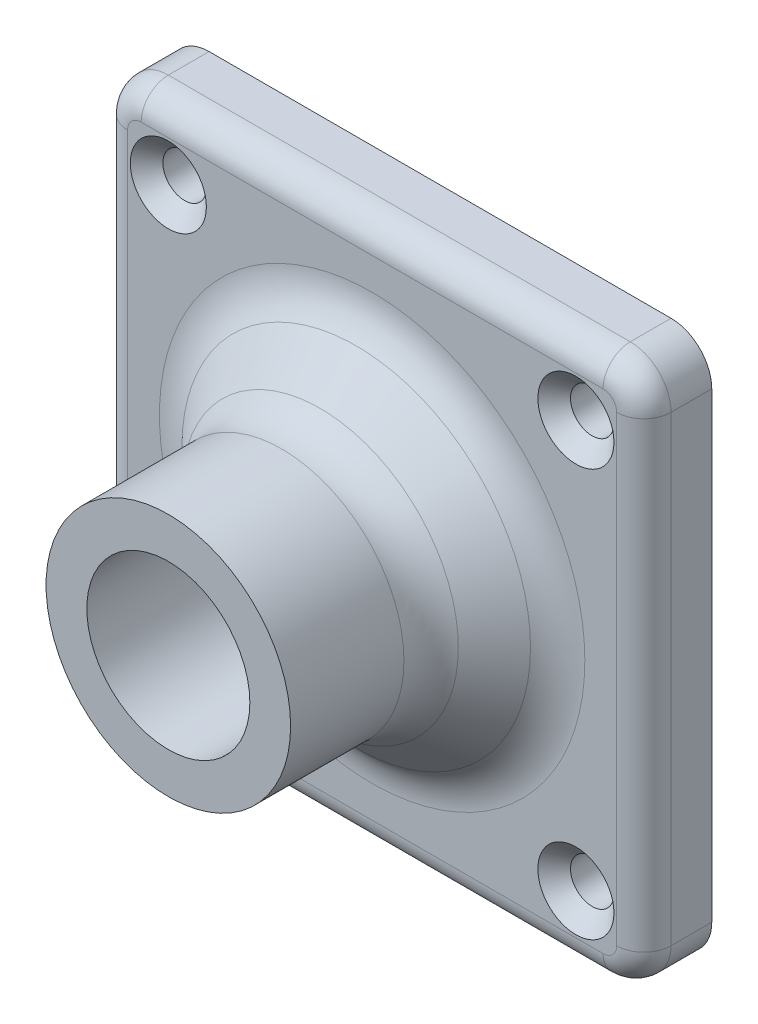
ISO-10303-21;
HEADER;
FILE_DESCRIPTION(('STEP AP214'),'2;1');
FILE_NAME('part.step','',(''),(''),'','','');
FILE_SCHEMA(('AUTOMOTIVE_DESIGN { 1 0 10303 214 1 1 1 1 }'));
ENDSEC;
DATA;
#1=APPLICATION_CONTEXT('core data for automotive mechanical design processes');
#2=APPLICATION_PROTOCOL_DEFINITION('international standard','automotive_design',2000,#1);
#3=PRODUCT_CONTEXT('',#1,'mechanical');
#4=PRODUCT('Part','Part','',(#3));
#5=PRODUCT_RELATED_PRODUCT_CATEGORY('part','',(#4));
#6=PRODUCT_DEFINITION_FORMATION('','',#4);
#7=PRODUCT_DEFINITION_CONTEXT('part definition',#1,'design');
#8=PRODUCT_DEFINITION('design','',#6,#7);
#9=PRODUCT_DEFINITION_SHAPE('','',#8);
#10=(LENGTH_UNIT() NAMED_UNIT(*) SI_UNIT(.MILLI.,.METRE.));
#11=(NAMED_UNIT(*) PLANE_ANGLE_UNIT() SI_UNIT($,.RADIAN.));
#12=(NAMED_UNIT(*) SI_UNIT($,.STERADIAN.) SOLID_ANGLE_UNIT());
#13=UNCERTAINTY_MEASURE_WITH_UNIT(LENGTH_MEASURE(1.E-05),#10,'distance_accuracy_value','');
#14=(GEOMETRIC_REPRESENTATION_CONTEXT(3) GLOBAL_UNCERTAINTY_ASSIGNED_CONTEXT((#13)) GLOBAL_UNIT_ASSIGNED_CONTEXT((#10,
#11,#12)) REPRESENTATION_CONTEXT('',''));
#15=CARTESIAN_POINT('',(0.,0.,0.));
#16=DIRECTION('',(0.,0.,1.));
#17=DIRECTION('',(1.,0.,0.));
#18=AXIS2_PLACEMENT_3D('',#15,#16,#17);
#19=CARTESIAN_POINT('',(-135.000000000005,-82.312657818665,20.));
#20=DIRECTION('',(0.,0.,1.));
#21=DIRECTION('',(1.,0.,0.));
#22=AXIS2_PLACEMENT_3D('',#19,#20,#21);
#23=PLANE('',#22);
#24=CARTESIAN_POINT('',(-135.000000000005,-82.312657818665,20.));
#25=DIRECTION('',(0.,0.,1.));
#26=DIRECTION('',(1.,0.,0.));
#27=AXIS2_PLACEMENT_3D('',#24,#25,#26);
#28=CIRCLE('',#27,9.00000000000001);
#29=CARTESIAN_POINT('',(-126.000000000005,-82.312657818665,20.));
#30=VERTEX_POINT('',#29);
#31=EDGE_CURVE('E191',#30,#30,#28,.T.);
#32=ORIENTED_EDGE('',*,*,#31,.T.);
#33=EDGE_LOOP('',(#32));
#34=FACE_BOUND('',#33,.T.);
#35=CARTESIAN_POINT('',(-135.000000000005,-82.312657818665,20.));
#36=DIRECTION('',(0.,0.,1.));
#37=DIRECTION('',(1.,0.,0.));
#38=AXIS2_PLACEMENT_3D('',#35,#36,#37);
#39=CIRCLE('',#38,5.99999999999999);
#40=CARTESIAN_POINT('',(-129.000000000005,-82.312657818665,20.));
#41=VERTEX_POINT('',#40);
#42=EDGE_CURVE('E188',#41,#41,#39,.T.);
#43=ORIENTED_EDGE('',*,*,#42,.F.);
#44=EDGE_LOOP('',(#43));
#45=FACE_BOUND('',#44,.T.);
#46=ADVANCED_FACE('F35',(#34,#45),#23,.T.);
#47=CARTESIAN_POINT('',(-135.000000000005,-82.312657818665,0.));
#48=DIRECTION('',(0.,0.,1.));
#49=DIRECTION('',(1.,0.,0.));
#50=AXIS2_PLACEMENT_3D('',#47,#48,#49);
#51=PLANE('',#50);
#52=CARTESIAN_POINT('',(-150.000000000005,-97.312657818665,0.));
#53=DIRECTION('',(0.,0.,1.));
#54=DIRECTION('',(1.,0.,0.));
#55=AXIS2_PLACEMENT_3D('',#52,#53,#54);
#56=CIRCLE('',#55,1.59999999999999);
#57=CARTESIAN_POINT('',(-148.400000000005,-97.312657818665,0.));
#58=VERTEX_POINT('',#57);
#59=EDGE_CURVE('E158',#58,#58,#56,.T.);
#60=ORIENTED_EDGE('',*,*,#59,.T.);
#61=EDGE_LOOP('',(#60));
#62=FACE_BOUND('',#61,.T.);
#63=CARTESIAN_POINT('',(-120.000000000005,-97.312657818665,0.));
#64=DIRECTION('',(0.,0.,1.));
#65=DIRECTION('',(1.,0.,0.));
#66=AXIS2_PLACEMENT_3D('',#63,#64,#65);
#67=CIRCLE('',#66,1.59999999999999);
#68=CARTESIAN_POINT('',(-118.400000000005,-97.312657818665,0.));
#69=VERTEX_POINT('',#68);
#70=EDGE_CURVE('E389',#69,#69,#67,.T.);
#71=ORIENTED_EDGE('',*,*,#70,.T.);
#72=EDGE_LOOP('',(#71));
#73=FACE_BOUND('',#72,.T.);
#74=CARTESIAN_POINT('',(-120.000000000005,-67.312657818665,0.));
#75=DIRECTION('',(0.,0.,1.));
#76=DIRECTION('',(1.,0.,0.));
#77=AXIS2_PLACEMENT_3D('',#74,#75,#76);
#78=CIRCLE('',#77,1.59999999999999);
#79=CARTESIAN_POINT('',(-118.400000000005,-67.312657818665,0.));
#80=VERTEX_POINT('',#79);
#81=EDGE_CURVE('E386',#80,#80,#78,.T.);
#82=ORIENTED_EDGE('',*,*,#81,.T.);
#83=EDGE_LOOP('',(#82));
#84=FACE_BOUND('',#83,.T.);
#85=CARTESIAN_POINT('',(-150.000000000005,-67.312657818665,0.));
#86=DIRECTION('',(0.,0.,1.));
#87=DIRECTION('',(1.,0.,0.));
#88=AXIS2_PLACEMENT_3D('',#85,#86,#87);
#89=CIRCLE('',#88,1.59999999999999);
#90=CARTESIAN_POINT('',(-148.400000000005,-67.312657818665,0.));
#91=VERTEX_POINT('',#90);
#92=EDGE_CURVE('E384',#91,#91,#89,.T.);
#93=ORIENTED_EDGE('',*,*,#92,.T.);
#94=EDGE_LOOP('',(#93));
#95=FACE_BOUND('',#94,.T.);
#96=CARTESIAN_POINT('',(-135.000000000005,-82.312657818665,0.));
#97=DIRECTION('',(0.,0.,1.));
#98=DIRECTION('',(1.,0.,0.));
#99=AXIS2_PLACEMENT_3D('',#96,#97,#98);
#100=CIRCLE('',#99,5.99999999999999);
#101=CARTESIAN_POINT('',(-129.000000000005,-82.312657818665,0.));
#102=VERTEX_POINT('',#101);
#103=EDGE_CURVE('E176',#102,#102,#100,.T.);
#104=ORIENTED_EDGE('',*,*,#103,.T.);
#105=EDGE_LOOP('',(#104));
#106=FACE_BOUND('',#105,.T.);
#107=CARTESIAN_POINT('',(-118.000000000005,-99.312657818665,0.));
#108=DIRECTION('',(0.,0.,-1.));
#109=DIRECTION('',(1.,0.,0.));
#110=AXIS2_PLACEMENT_3D('',#107,#108,#109);
#111=CIRCLE('',#110,3.);
#112=CARTESIAN_POINT('',(-115.000000000005,-99.312657818665,0.));
#113=VERTEX_POINT('',#112);
#114=CARTESIAN_POINT('',(-118.000000000005,-102.312657818665,0.));
#115=VERTEX_POINT('',#114);
#116=EDGE_CURVE('E131',#113,#115,#111,.T.);
#117=ORIENTED_EDGE('',*,*,#116,.T.);
#118=DIRECTION('',(-1.,0.,0.));
#119=VECTOR('',#118,1.);
#120=CARTESIAN_POINT('',(-152.000000000005,-102.312657818665,0.));
#121=LINE('',#120,#119);
#122=CARTESIAN_POINT('',(-152.000000000005,-102.312657818665,0.));
#123=VERTEX_POINT('',#122);
#124=EDGE_CURVE('E141',#115,#123,#121,.T.);
#125=ORIENTED_EDGE('',*,*,#124,.T.);
#126=CARTESIAN_POINT('',(-152.000000000005,-99.312657818665,0.));
#127=DIRECTION('',(0.,0.,-1.));
#128=DIRECTION('',(-1.,0.,0.));
#129=AXIS2_PLACEMENT_3D('',#126,#127,#128);
#130=CIRCLE('',#129,3.00000000000002);
#131=CARTESIAN_POINT('',(-155.000000000005,-99.312657818665,0.));
#132=VERTEX_POINT('',#131);
#133=EDGE_CURVE('E147',#123,#132,#130,.T.);
#134=ORIENTED_EDGE('',*,*,#133,.T.);
#135=DIRECTION('',(0.,1.,0.));
#136=VECTOR('',#135,1.);
#137=CARTESIAN_POINT('',(-155.000000000005,-99.312657818665,0.));
#138=LINE('',#137,#136);
#139=CARTESIAN_POINT('',(-155.000000000005,-65.312657818665,0.));
#140=VERTEX_POINT('',#139);
#141=EDGE_CURVE('E162',#132,#140,#138,.T.);
#142=ORIENTED_EDGE('',*,*,#141,.T.);
#143=CARTESIAN_POINT('',(-152.000000000005,-65.312657818665,0.));
#144=DIRECTION('',(0.,0.,-1.));
#145=DIRECTION('',(-1.,0.,0.));
#146=AXIS2_PLACEMENT_3D('',#143,#144,#145);
#147=CIRCLE('',#146,3.);
#148=CARTESIAN_POINT('',(-152.000000000005,-62.312657818665,0.));
#149=VERTEX_POINT('',#148);
#150=EDGE_CURVE('E165',#140,#149,#147,.T.);
#151=ORIENTED_EDGE('',*,*,#150,.T.);
#152=DIRECTION('',(1.,0.,0.));
#153=VECTOR('',#152,1.);
#154=CARTESIAN_POINT('',(-152.000000000005,-62.312657818665,0.));
#155=LINE('',#154,#153);
#156=CARTESIAN_POINT('',(-118.000000000005,-62.312657818665,0.));
#157=VERTEX_POINT('',#156);
#158=EDGE_CURVE('E168',#149,#157,#155,.T.);
#159=ORIENTED_EDGE('',*,*,#158,.T.);
#160=CARTESIAN_POINT('',(-118.000000000005,-65.312657818665,0.));
#161=DIRECTION('',(0.,0.,-1.));
#162=DIRECTION('',(-1.,0.,0.));
#163=AXIS2_PLACEMENT_3D('',#160,#161,#162);
#164=CIRCLE('',#163,2.99999999999999);
#165=CARTESIAN_POINT('',(-115.000000000005,-65.312657818665,0.));
#166=VERTEX_POINT('',#165);
#167=EDGE_CURVE('E171',#157,#166,#164,.T.);
#168=ORIENTED_EDGE('',*,*,#167,.T.);
#169=DIRECTION('',(0.,-1.,0.));
#170=VECTOR('',#169,1.);
#171=CARTESIAN_POINT('',(-115.000000000005,-99.312657818665,0.));
#172=LINE('',#171,#170);
#173=EDGE_CURVE('E138',#166,#113,#172,.T.);
#174=ORIENTED_EDGE('',*,*,#173,.T.);
#175=EDGE_LOOP('',(#117,#125,#134,#142,#151,#159,#168,#174));
#176=FACE_BOUND('',#175,.T.);
#177=ADVANCED_FACE('F149',(#62,#73,#84,#95,#106,#176),#51,.F.);
#178=CARTESIAN_POINT('',(-135.000000000005,-82.312657818665,20.));
#179=DIRECTION('',(0.,0.,-1.));
#180=DIRECTION('',(-1.,0.,0.));
#181=AXIS2_PLACEMENT_3D('',#178,#179,#180);
#182=CYLINDRICAL_SURFACE('',#181,9.00000000000001);
#183=CARTESIAN_POINT('',(-135.000000000005,-82.312657818665,11.6568542494924));
#184=DIRECTION('',(0.,0.,1.));
#185=DIRECTION('',(1.,0.,0.));
#186=AXIS2_PLACEMENT_3D('',#183,#184,#185);
#187=CIRCLE('',#186,9.00000000000001);
#188=CARTESIAN_POINT('',(-126.000000000005,-82.312657818665,11.6568542494924));
#189=VERTEX_POINT('',#188);
#190=EDGE_CURVE('E227',#189,#189,#187,.T.);
#191=ORIENTED_EDGE('',*,*,#190,.T.);
#192=EDGE_LOOP('',(#191));
#193=FACE_BOUND('',#192,.T.);
#194=ORIENTED_EDGE('',*,*,#31,.F.);
#195=EDGE_LOOP('',(#194));
#196=FACE_BOUND('',#195,.T.);
#197=ADVANCED_FACE('F300',(#193,#196),#182,.T.);
#198=CARTESIAN_POINT('',(-135.000000000005,-82.312657818665,20.));
#199=DIRECTION('',(0.,0.,-1.));
#200=DIRECTION('',(-1.,0.,0.));
#201=AXIS2_PLACEMENT_3D('',#198,#199,#200);
#202=CYLINDRICAL_SURFACE('',#201,5.99999999999999);
#203=ORIENTED_EDGE('',*,*,#42,.T.);
#204=EDGE_LOOP('',(#203));
#205=FACE_BOUND('',#204,.T.);
#206=ORIENTED_EDGE('',*,*,#103,.F.);
#207=EDGE_LOOP('',(#206));
#208=FACE_BOUND('',#207,.T.);
#209=ADVANCED_FACE('F305',(#205,#208),#202,.F.);
#210=CARTESIAN_POINT('',(-118.000000000005,-99.312657818665,5.));
#211=DIRECTION('',(0.,0.,1.));
#212=DIRECTION('',(1.,0.,0.));
#213=AXIS2_PLACEMENT_3D('',#210,#211,#212);
#214=PLANE('',#213);
#215=CARTESIAN_POINT('',(-150.000000000005,-67.312657818665,5.));
#216=DIRECTION('',(0.,0.,1.));
#217=DIRECTION('',(1.,0.,0.));
#218=AXIS2_PLACEMENT_3D('',#215,#216,#217);
#219=CIRCLE('',#218,2.8);
#220=CARTESIAN_POINT('',(-147.200000000005,-67.312657818665,5.));
#221=VERTEX_POINT('',#220);
#222=EDGE_CURVE('E269',#221,#221,#219,.F.);
#223=ORIENTED_EDGE('',*,*,#222,.T.);
#224=EDGE_LOOP('',(#223));
#225=FACE_BOUND('',#224,.T.);
#226=CARTESIAN_POINT('',(-120.000000000005,-67.312657818665,5.));
#227=DIRECTION('',(0.,0.,1.));
#228=DIRECTION('',(1.,0.,0.));
#229=AXIS2_PLACEMENT_3D('',#226,#227,#228);
#230=CIRCLE('',#229,2.8);
#231=CARTESIAN_POINT('',(-117.200000000005,-67.312657818665,5.));
#232=VERTEX_POINT('',#231);
#233=EDGE_CURVE('E266',#232,#232,#230,.F.);
#234=ORIENTED_EDGE('',*,*,#233,.T.);
#235=EDGE_LOOP('',(#234));
#236=FACE_BOUND('',#235,.T.);
#237=CARTESIAN_POINT('',(-120.000000000005,-97.312657818665,5.));
#238=DIRECTION('',(0.,0.,1.));
#239=DIRECTION('',(1.,0.,0.));
#240=AXIS2_PLACEMENT_3D('',#237,#238,#239);
#241=CIRCLE('',#240,2.8);
#242=CARTESIAN_POINT('',(-117.200000000005,-97.312657818665,5.));
#243=VERTEX_POINT('',#242);
#244=EDGE_CURVE('E263',#243,#243,#241,.F.);
#245=ORIENTED_EDGE('',*,*,#244,.T.);
#246=EDGE_LOOP('',(#245));
#247=FACE_BOUND('',#246,.T.);
#248=CARTESIAN_POINT('',(-150.000000000005,-97.312657818665,5.));
#249=DIRECTION('',(0.,0.,1.));
#250=DIRECTION('',(1.,0.,0.));
#251=AXIS2_PLACEMENT_3D('',#248,#249,#250);
#252=CIRCLE('',#251,2.8);
#253=CARTESIAN_POINT('',(-147.200000000005,-97.312657818665,5.));
#254=VERTEX_POINT('',#253);
#255=EDGE_CURVE('E260',#254,#254,#252,.F.);
#256=ORIENTED_EDGE('',*,*,#255,.T.);
#257=EDGE_LOOP('',(#256));
#258=FACE_BOUND('',#257,.T.);
#259=CARTESIAN_POINT('',(-135.000000000005,-82.312657818665,5.));
#260=DIRECTION('',(0.,0.,1.));
#261=DIRECTION('',(1.,0.,0.));
#262=AXIS2_PLACEMENT_3D('',#259,#260,#261);
#263=CIRCLE('',#262,15.6568542494924);
#264=CARTESIAN_POINT('',(-119.343145750513,-82.312657818665,5.));
#265=VERTEX_POINT('',#264);
#266=EDGE_CURVE('E254',#265,#265,#263,.F.);
#267=ORIENTED_EDGE('',*,*,#266,.T.);
#268=EDGE_LOOP('',(#267));
#269=FACE_BOUND('',#268,.T.);
#270=DIRECTION('',(0.,1.,0.));
#271=VECTOR('',#270,1.);
#272=CARTESIAN_POINT('',(-153.000000000005,-99.312657818665,5.));
#273=LINE('',#272,#271);
#274=CARTESIAN_POINT('',(-153.000000000005,-65.312657818665,5.));
#275=VERTEX_POINT('',#274);
#276=CARTESIAN_POINT('',(-153.000000000005,-99.312657818665,5.));
#277=VERTEX_POINT('',#276);
#278=EDGE_CURVE('E199',#275,#277,#273,.F.);
#279=ORIENTED_EDGE('',*,*,#278,.T.);
#280=CARTESIAN_POINT('',(-152.000000000005,-99.312657818665,5.));
#281=DIRECTION('',(0.,0.,1.));
#282=DIRECTION('',(1.,0.,0.));
#283=AXIS2_PLACEMENT_3D('',#280,#281,#282);
#284=CIRCLE('',#283,1.00000000000002);
#285=CARTESIAN_POINT('',(-152.000000000005,-100.312657818665,5.));
#286=VERTEX_POINT('',#285);
#287=EDGE_CURVE('E213',#277,#286,#284,.T.);
#288=ORIENTED_EDGE('',*,*,#287,.T.);
#289=DIRECTION('',(-1.,0.,0.));
#290=VECTOR('',#289,1.);
#291=CARTESIAN_POINT('',(-118.000000000005,-100.312657818665,5.));
#292=LINE('',#291,#290);
#293=CARTESIAN_POINT('',(-118.000000000005,-100.312657818665,5.));
#294=VERTEX_POINT('',#293);
#295=EDGE_CURVE('E211',#286,#294,#292,.F.);
#296=ORIENTED_EDGE('',*,*,#295,.T.);
#297=CARTESIAN_POINT('',(-118.000000000005,-99.312657818665,5.));
#298=DIRECTION('',(0.,0.,1.));
#299=DIRECTION('',(1.,0.,0.));
#300=AXIS2_PLACEMENT_3D('',#297,#298,#299);
#301=CIRCLE('',#300,1.);
#302=CARTESIAN_POINT('',(-117.000000000005,-99.312657818665,5.));
#303=VERTEX_POINT('',#302);
#304=EDGE_CURVE('E209',#294,#303,#301,.T.);
#305=ORIENTED_EDGE('',*,*,#304,.T.);
#306=DIRECTION('',(0.,-1.,0.));
#307=VECTOR('',#306,1.);
#308=CARTESIAN_POINT('',(-117.000000000005,-99.312657818665,5.));
#309=LINE('',#308,#307);
#310=CARTESIAN_POINT('',(-117.000000000005,-65.312657818665,5.));
#311=VERTEX_POINT('',#310);
#312=EDGE_CURVE('E207',#303,#311,#309,.F.);
#313=ORIENTED_EDGE('',*,*,#312,.T.);
#314=CARTESIAN_POINT('',(-118.000000000005,-65.312657818665,5.));
#315=DIRECTION('',(0.,0.,1.));
#316=DIRECTION('',(1.,0.,0.));
#317=AXIS2_PLACEMENT_3D('',#314,#315,#316);
#318=CIRCLE('',#317,0.999999999999992);
#319=CARTESIAN_POINT('',(-118.000000000005,-64.312657818665,5.));
#320=VERTEX_POINT('',#319);
#321=EDGE_CURVE('E205',#311,#320,#318,.T.);
#322=ORIENTED_EDGE('',*,*,#321,.T.);
#323=DIRECTION('',(1.,0.,0.));
#324=VECTOR('',#323,1.);
#325=CARTESIAN_POINT('',(-118.000000000005,-64.312657818665,5.));
#326=LINE('',#325,#324);
#327=CARTESIAN_POINT('',(-152.000000000005,-64.312657818665,5.));
#328=VERTEX_POINT('',#327);
#329=EDGE_CURVE('E203',#320,#328,#326,.F.);
#330=ORIENTED_EDGE('',*,*,#329,.T.);
#331=CARTESIAN_POINT('',(-152.000000000005,-65.312657818665,5.));
#332=DIRECTION('',(0.,0.,1.));
#333=DIRECTION('',(1.,0.,0.));
#334=AXIS2_PLACEMENT_3D('',#331,#332,#333);
#335=CIRCLE('',#334,0.999999999999999);
#336=EDGE_CURVE('E201',#328,#275,#335,.T.);
#337=ORIENTED_EDGE('',*,*,#336,.T.);
#338=EDGE_LOOP('',(#279,#288,#296,#305,#313,#322,#330,#337));
#339=FACE_BOUND('',#338,.T.);
#340=ADVANCED_FACE('F406',(#225,#236,#247,#258,#269,#339),#214,.T.);
#341=CARTESIAN_POINT('',(-118.000000000005,-99.312657818665,5.));
#342=DIRECTION('',(0.,0.,-1.));
#343=DIRECTION('',(-1.,0.,0.));
#344=AXIS2_PLACEMENT_3D('',#341,#342,#343);
#345=CYLINDRICAL_SURFACE('',#344,3.);
#346=DIRECTION('',(0.,0.,-1.));
#347=VECTOR('',#346,1.);
#348=CARTESIAN_POINT('',(-115.000000000005,-99.312657818665,5.));
#349=LINE('',#348,#347);
#350=CARTESIAN_POINT('',(-115.000000000005,-99.312657818665,3.));
#351=VERTEX_POINT('',#350);
#352=EDGE_CURVE('E174',#351,#113,#349,.T.);
#353=ORIENTED_EDGE('',*,*,#352,.F.);
#354=CARTESIAN_POINT('',(-118.000000000005,-99.312657818665,3.));
#355=DIRECTION('',(0.,0.,1.));
#356=DIRECTION('',(1.,0.,0.));
#357=AXIS2_PLACEMENT_3D('',#354,#355,#356);
#358=CIRCLE('',#357,3.);
#359=CARTESIAN_POINT('',(-118.000000000005,-102.312657818665,3.));
#360=VERTEX_POINT('',#359);
#361=EDGE_CURVE('E134',#351,#360,#358,.F.);
#362=ORIENTED_EDGE('',*,*,#361,.T.);
#363=DIRECTION('',(0.,0.,-1.));
#364=VECTOR('',#363,1.);
#365=CARTESIAN_POINT('',(-118.000000000005,-102.312657818665,5.));
#366=LINE('',#365,#364);
#367=EDGE_CURVE('E126',#360,#115,#366,.T.);
#368=ORIENTED_EDGE('',*,*,#367,.T.);
#369=ORIENTED_EDGE('',*,*,#116,.F.);
#370=EDGE_LOOP('',(#353,#362,#368,#369));
#371=FACE_BOUND('',#370,.T.);
#372=ADVANCED_FACE('F129',(#371),#345,.T.);
#373=CARTESIAN_POINT('',(-115.000000000005,-99.312657818665,5.));
#374=DIRECTION('',(1.,0.,0.));
#375=DIRECTION('',(0.,0.,-1.));
#376=AXIS2_PLACEMENT_3D('',#373,#374,#375);
#377=PLANE('',#376);
#378=DIRECTION('',(0.,0.,-1.));
#379=VECTOR('',#378,1.);
#380=CARTESIAN_POINT('',(-115.000000000005,-65.312657818665,5.));
#381=LINE('',#380,#379);
#382=CARTESIAN_POINT('',(-115.000000000005,-65.312657818665,3.));
#383=VERTEX_POINT('',#382);
#384=EDGE_CURVE('E177',#383,#166,#381,.T.);
#385=ORIENTED_EDGE('',*,*,#384,.F.);
#386=DIRECTION('',(0.,-1.,0.));
#387=VECTOR('',#386,1.);
#388=CARTESIAN_POINT('',(-115.000000000005,-99.312657818665,3.));
#389=LINE('',#388,#387);
#390=EDGE_CURVE('E219',#383,#351,#389,.T.);
#391=ORIENTED_EDGE('',*,*,#390,.T.);
#392=ORIENTED_EDGE('',*,*,#352,.T.);
#393=ORIENTED_EDGE('',*,*,#173,.F.);
#394=EDGE_LOOP('',(#385,#391,#392,#393));
#395=FACE_BOUND('',#394,.T.);
#396=ADVANCED_FACE('F410',(#395),#377,.T.);
#397=CARTESIAN_POINT('',(-118.000000000005,-65.312657818665,5.));
#398=DIRECTION('',(0.,0.,-1.));
#399=DIRECTION('',(-1.,0.,0.));
#400=AXIS2_PLACEMENT_3D('',#397,#398,#399);
#401=CYLINDRICAL_SURFACE('',#400,2.99999999999999);
#402=DIRECTION('',(0.,0.,-1.));
#403=VECTOR('',#402,1.);
#404=CARTESIAN_POINT('',(-118.000000000005,-62.312657818665,5.));
#405=LINE('',#404,#403);
#406=CARTESIAN_POINT('',(-118.000000000005,-62.312657818665,3.));
#407=VERTEX_POINT('',#406);
#408=EDGE_CURVE('E179',#407,#157,#405,.T.);
#409=ORIENTED_EDGE('',*,*,#408,.F.);
#410=CARTESIAN_POINT('',(-118.000000000005,-65.312657818665,3.));
#411=DIRECTION('',(0.,0.,1.));
#412=DIRECTION('',(1.,0.,0.));
#413=AXIS2_PLACEMENT_3D('',#410,#411,#412);
#414=CIRCLE('',#413,2.99999999999999);
#415=EDGE_CURVE('E221',#407,#383,#414,.F.);
#416=ORIENTED_EDGE('',*,*,#415,.T.);
#417=ORIENTED_EDGE('',*,*,#384,.T.);
#418=ORIENTED_EDGE('',*,*,#167,.F.);
#419=EDGE_LOOP('',(#409,#416,#417,#418));
#420=FACE_BOUND('',#419,.T.);
#421=ADVANCED_FACE('F413',(#420),#401,.T.);
#422=CARTESIAN_POINT('',(-152.000000000005,-62.312657818665,5.));
#423=DIRECTION('',(0.,1.,0.));
#424=DIRECTION('',(-1.,0.,0.));
#425=AXIS2_PLACEMENT_3D('',#422,#423,#424);
#426=PLANE('',#425);
#427=DIRECTION('',(0.,0.,-1.));
#428=VECTOR('',#427,1.);
#429=CARTESIAN_POINT('',(-152.000000000005,-62.312657818665,5.));
#430=LINE('',#429,#428);
#431=CARTESIAN_POINT('',(-152.000000000005,-62.312657818665,3.));
#432=VERTEX_POINT('',#431);
#433=EDGE_CURVE('E181',#432,#149,#430,.T.);
#434=ORIENTED_EDGE('',*,*,#433,.F.);
#435=DIRECTION('',(1.,0.,0.));
#436=VECTOR('',#435,1.);
#437=CARTESIAN_POINT('',(-152.000000000005,-62.312657818665,3.));
#438=LINE('',#437,#436);
#439=EDGE_CURVE('E223',#432,#407,#438,.T.);
#440=ORIENTED_EDGE('',*,*,#439,.T.);
#441=ORIENTED_EDGE('',*,*,#408,.T.);
#442=ORIENTED_EDGE('',*,*,#158,.F.);
#443=EDGE_LOOP('',(#434,#440,#441,#442));
#444=FACE_BOUND('',#443,.T.);
#445=ADVANCED_FACE('F417',(#444),#426,.T.);
#446=CARTESIAN_POINT('',(-152.000000000005,-65.312657818665,5.));
#447=DIRECTION('',(0.,0.,-1.));
#448=DIRECTION('',(-1.,0.,0.));
#449=AXIS2_PLACEMENT_3D('',#446,#447,#448);
#450=CYLINDRICAL_SURFACE('',#449,3.);
#451=DIRECTION('',(0.,0.,-1.));
#452=VECTOR('',#451,1.);
#453=CARTESIAN_POINT('',(-155.000000000005,-65.312657818665,5.));
#454=LINE('',#453,#452);
#455=CARTESIAN_POINT('',(-155.000000000005,-65.312657818665,3.));
#456=VERTEX_POINT('',#455);
#457=EDGE_CURVE('E183',#456,#140,#454,.T.);
#458=ORIENTED_EDGE('',*,*,#457,.F.);
#459=CARTESIAN_POINT('',(-152.000000000005,-65.312657818665,3.));
#460=DIRECTION('',(0.,0.,1.));
#461=DIRECTION('',(1.,0.,0.));
#462=AXIS2_PLACEMENT_3D('',#459,#460,#461);
#463=CIRCLE('',#462,3.);
#464=EDGE_CURVE('E58',#456,#432,#463,.F.);
#465=ORIENTED_EDGE('',*,*,#464,.T.);
#466=ORIENTED_EDGE('',*,*,#433,.T.);
#467=ORIENTED_EDGE('',*,*,#150,.F.);
#468=EDGE_LOOP('',(#458,#465,#466,#467));
#469=FACE_BOUND('',#468,.T.);
#470=ADVANCED_FACE('F421',(#469),#450,.T.);
#471=CARTESIAN_POINT('',(-155.000000000005,-99.312657818665,5.));
#472=DIRECTION('',(-1.,0.,0.));
#473=DIRECTION('',(0.,-1.,0.));
#474=AXIS2_PLACEMENT_3D('',#471,#472,#473);
#475=PLANE('',#474);
#476=DIRECTION('',(0.,0.,-1.));
#477=VECTOR('',#476,1.);
#478=CARTESIAN_POINT('',(-155.000000000005,-99.312657818665,5.));
#479=LINE('',#478,#477);
#480=CARTESIAN_POINT('',(-155.000000000005,-99.312657818665,3.));
#481=VERTEX_POINT('',#480);
#482=EDGE_CURVE('E185',#481,#132,#479,.T.);
#483=ORIENTED_EDGE('',*,*,#482,.F.);
#484=DIRECTION('',(0.,1.,0.));
#485=VECTOR('',#484,1.);
#486=CARTESIAN_POINT('',(-155.000000000005,-99.312657818665,3.));
#487=LINE('',#486,#485);
#488=EDGE_CURVE('E51',#481,#456,#487,.T.);
#489=ORIENTED_EDGE('',*,*,#488,.T.);
#490=ORIENTED_EDGE('',*,*,#457,.T.);
#491=ORIENTED_EDGE('',*,*,#141,.F.);
#492=EDGE_LOOP('',(#483,#489,#490,#491));
#493=FACE_BOUND('',#492,.T.);
#494=ADVANCED_FACE('F425',(#493),#475,.T.);
#495=CARTESIAN_POINT('',(-152.000000000005,-99.312657818665,5.));
#496=DIRECTION('',(0.,0.,-1.));
#497=DIRECTION('',(-1.,0.,0.));
#498=AXIS2_PLACEMENT_3D('',#495,#496,#497);
#499=CYLINDRICAL_SURFACE('',#498,3.00000000000002);
#500=DIRECTION('',(0.,0.,-1.));
#501=VECTOR('',#500,1.);
#502=CARTESIAN_POINT('',(-152.000000000005,-102.312657818665,5.));
#503=LINE('',#502,#501);
#504=CARTESIAN_POINT('',(-152.000000000005,-102.312657818665,3.));
#505=VERTEX_POINT('',#504);
#506=EDGE_CURVE('E137',#505,#123,#503,.T.);
#507=ORIENTED_EDGE('',*,*,#506,.F.);
#508=CARTESIAN_POINT('',(-152.000000000005,-99.312657818665,3.));
#509=DIRECTION('',(0.,0.,1.));
#510=DIRECTION('',(1.,0.,0.));
#511=AXIS2_PLACEMENT_3D('',#508,#509,#510);
#512=CIRCLE('',#511,3.00000000000002);
#513=EDGE_CURVE('E196',#505,#481,#512,.F.);
#514=ORIENTED_EDGE('',*,*,#513,.T.);
#515=ORIENTED_EDGE('',*,*,#482,.T.);
#516=ORIENTED_EDGE('',*,*,#133,.F.);
#517=EDGE_LOOP('',(#507,#514,#515,#516));
#518=FACE_BOUND('',#517,.T.);
#519=ADVANCED_FACE('F428',(#518),#499,.T.);
#520=CARTESIAN_POINT('',(-152.000000000005,-102.312657818665,5.));
#521=DIRECTION('',(0.,-1.,0.));
#522=DIRECTION('',(1.,0.,0.));
#523=AXIS2_PLACEMENT_3D('',#520,#521,#522);
#524=PLANE('',#523);
#525=ORIENTED_EDGE('',*,*,#367,.F.);
#526=DIRECTION('',(-1.,0.,0.));
#527=VECTOR('',#526,1.);
#528=CARTESIAN_POINT('',(-152.000000000005,-102.312657818665,3.));
#529=LINE('',#528,#527);
#530=EDGE_CURVE('E216',#360,#505,#529,.T.);
#531=ORIENTED_EDGE('',*,*,#530,.T.);
#532=ORIENTED_EDGE('',*,*,#506,.T.);
#533=ORIENTED_EDGE('',*,*,#124,.F.);
#534=EDGE_LOOP('',(#525,#531,#532,#533));
#535=FACE_BOUND('',#534,.T.);
#536=ADVANCED_FACE('F142',(#535),#524,.T.);
#537=CARTESIAN_POINT('',(-118.000000000005,-65.312657818665,3.));
#538=DIRECTION('',(0.,0.,1.));
#539=DIRECTION('',(1.,0.,0.));
#540=AXIS2_PLACEMENT_3D('',#537,#538,#539);
#541=DEGENERATE_TOROIDAL_SURFACE('',#540,0.999999999999992,2.,.T.);
#542=CARTESIAN_POINT('',(-118.000000000005,-64.312657818665,3.));
#543=DIRECTION('',(-1.,0.,0.));
#544=DIRECTION('',(0.,0.,1.));
#545=AXIS2_PLACEMENT_3D('',#542,#543,#544);
#546=CIRCLE('',#545,2.);
#547=EDGE_CURVE('E155',#320,#407,#546,.T.);
#548=ORIENTED_EDGE('',*,*,#547,.F.);
#549=ORIENTED_EDGE('',*,*,#321,.F.);
#550=CARTESIAN_POINT('',(-117.000000000005,-65.312657818665,3.));
#551=DIRECTION('',(0.,-1.,0.));
#552=DIRECTION('',(0.,0.,-1.));
#553=AXIS2_PLACEMENT_3D('',#550,#551,#552);
#554=CIRCLE('',#553,2.);
#555=EDGE_CURVE('E152',#383,#311,#554,.T.);
#556=ORIENTED_EDGE('',*,*,#555,.F.);
#557=ORIENTED_EDGE('',*,*,#415,.F.);
#558=EDGE_LOOP('',(#548,#549,#556,#557));
#559=FACE_BOUND('',#558,.T.);
#560=ADVANCED_FACE('F339',(#559),#541,.T.);
#561=CARTESIAN_POINT('',(-117.000000000005,-99.312657818665,3.));
#562=DIRECTION('',(0.,-1.,0.));
#563=DIRECTION('',(0.,0.,-1.));
#564=AXIS2_PLACEMENT_3D('',#561,#562,#563);
#565=CYLINDRICAL_SURFACE('',#564,2.);
#566=ORIENTED_EDGE('',*,*,#555,.T.);
#567=ORIENTED_EDGE('',*,*,#312,.F.);
#568=CARTESIAN_POINT('',(-117.000000000005,-99.312657818665,3.));
#569=DIRECTION('',(0.,-1.,0.));
#570=DIRECTION('',(0.,0.,-1.));
#571=AXIS2_PLACEMENT_3D('',#568,#569,#570);
#572=CIRCLE('',#571,2.);
#573=EDGE_CURVE('E241',#351,#303,#572,.T.);
#574=ORIENTED_EDGE('',*,*,#573,.F.);
#575=ORIENTED_EDGE('',*,*,#390,.F.);
#576=EDGE_LOOP('',(#566,#567,#574,#575));
#577=FACE_BOUND('',#576,.T.);
#578=ADVANCED_FACE('F335',(#577),#565,.T.);
#579=CARTESIAN_POINT('',(-152.000000000005,-64.312657818665,3.));
#580=DIRECTION('',(1.,0.,0.));
#581=DIRECTION('',(0.,1.,0.));
#582=AXIS2_PLACEMENT_3D('',#579,#580,#581);
#583=CYLINDRICAL_SURFACE('',#582,2.);
#584=ORIENTED_EDGE('',*,*,#547,.T.);
#585=ORIENTED_EDGE('',*,*,#439,.F.);
#586=CARTESIAN_POINT('',(-152.000000000005,-64.312657818665,3.));
#587=DIRECTION('',(-1.,0.,0.));
#588=DIRECTION('',(0.,0.,1.));
#589=AXIS2_PLACEMENT_3D('',#586,#587,#588);
#590=CIRCLE('',#589,2.);
#591=EDGE_CURVE('E238',#328,#432,#590,.T.);
#592=ORIENTED_EDGE('',*,*,#591,.F.);
#593=ORIENTED_EDGE('',*,*,#329,.F.);
#594=EDGE_LOOP('',(#584,#585,#592,#593));
#595=FACE_BOUND('',#594,.T.);
#596=ADVANCED_FACE('F331',(#595),#583,.T.);
#597=CARTESIAN_POINT('',(-118.000000000005,-99.312657818665,3.));
#598=DIRECTION('',(0.,0.,1.));
#599=DIRECTION('',(1.,0.,0.));
#600=AXIS2_PLACEMENT_3D('',#597,#598,#599);
#601=DEGENERATE_TOROIDAL_SURFACE('',#600,1.,2.,.T.);
#602=ORIENTED_EDGE('',*,*,#573,.T.);
#603=ORIENTED_EDGE('',*,*,#304,.F.);
#604=CARTESIAN_POINT('',(-118.000000000005,-100.312657818665,3.));
#605=DIRECTION('',(-1.,0.,0.));
#606=DIRECTION('',(0.,0.,1.));
#607=AXIS2_PLACEMENT_3D('',#604,#605,#606);
#608=CIRCLE('',#607,2.);
#609=EDGE_CURVE('E235',#360,#294,#608,.T.);
#610=ORIENTED_EDGE('',*,*,#609,.F.);
#611=ORIENTED_EDGE('',*,*,#361,.F.);
#612=EDGE_LOOP('',(#602,#603,#610,#611));
#613=FACE_BOUND('',#612,.T.);
#614=ADVANCED_FACE('F327',(#613),#601,.T.);
#615=CARTESIAN_POINT('',(-152.000000000005,-65.312657818665,3.));
#616=DIRECTION('',(0.,0.,1.));
#617=DIRECTION('',(1.,0.,0.));
#618=AXIS2_PLACEMENT_3D('',#615,#616,#617);
#619=DEGENERATE_TOROIDAL_SURFACE('',#618,0.999999999999999,2.,.T.);
#620=ORIENTED_EDGE('',*,*,#591,.T.);
#621=ORIENTED_EDGE('',*,*,#464,.F.);
#622=CARTESIAN_POINT('',(-153.000000000005,-65.312657818665,3.));
#623=DIRECTION('',(0.,-1.,0.));
#624=DIRECTION('',(0.,0.,-1.));
#625=AXIS2_PLACEMENT_3D('',#622,#623,#624);
#626=CIRCLE('',#625,2.);
#627=EDGE_CURVE('E232',#275,#456,#626,.T.);
#628=ORIENTED_EDGE('',*,*,#627,.F.);
#629=ORIENTED_EDGE('',*,*,#336,.F.);
#630=EDGE_LOOP('',(#620,#621,#628,#629));
#631=FACE_BOUND('',#630,.T.);
#632=ADVANCED_FACE('F323',(#631),#619,.T.);
#633=CARTESIAN_POINT('',(-152.000000000005,-100.312657818665,3.));
#634=DIRECTION('',(-1.,0.,0.));
#635=DIRECTION('',(0.,-1.,0.));
#636=AXIS2_PLACEMENT_3D('',#633,#634,#635);
#637=CYLINDRICAL_SURFACE('',#636,2.);
#638=ORIENTED_EDGE('',*,*,#609,.T.);
#639=ORIENTED_EDGE('',*,*,#295,.F.);
#640=CARTESIAN_POINT('',(-152.000000000005,-100.312657818665,3.));
#641=DIRECTION('',(-1.,0.,0.));
#642=DIRECTION('',(0.,0.,1.));
#643=AXIS2_PLACEMENT_3D('',#640,#641,#642);
#644=CIRCLE('',#643,2.);
#645=EDGE_CURVE('E230',#505,#286,#644,.T.);
#646=ORIENTED_EDGE('',*,*,#645,.F.);
#647=ORIENTED_EDGE('',*,*,#530,.F.);
#648=EDGE_LOOP('',(#638,#639,#646,#647));
#649=FACE_BOUND('',#648,.T.);
#650=ADVANCED_FACE('F319',(#649),#637,.T.);
#651=CARTESIAN_POINT('',(-153.000000000005,-99.312657818665,3.));
#652=DIRECTION('',(0.,1.,0.));
#653=DIRECTION('',(-1.,0.,0.));
#654=AXIS2_PLACEMENT_3D('',#651,#652,#653);
#655=CYLINDRICAL_SURFACE('',#654,2.);
#656=ORIENTED_EDGE('',*,*,#627,.T.);
#657=ORIENTED_EDGE('',*,*,#488,.F.);
#658=CARTESIAN_POINT('',(-153.000000000005,-99.312657818665,3.));
#659=DIRECTION('',(0.,-1.,0.));
#660=DIRECTION('',(0.,0.,-1.));
#661=AXIS2_PLACEMENT_3D('',#658,#659,#660);
#662=CIRCLE('',#661,2.);
#663=EDGE_CURVE('E228',#277,#481,#662,.T.);
#664=ORIENTED_EDGE('',*,*,#663,.F.);
#665=ORIENTED_EDGE('',*,*,#278,.F.);
#666=EDGE_LOOP('',(#656,#657,#664,#665));
#667=FACE_BOUND('',#666,.T.);
#668=ADVANCED_FACE('F315',(#667),#655,.T.);
#669=CARTESIAN_POINT('',(-152.000000000005,-99.312657818665,3.));
#670=DIRECTION('',(0.,0.,1.));
#671=DIRECTION('',(1.,0.,0.));
#672=AXIS2_PLACEMENT_3D('',#669,#670,#671);
#673=DEGENERATE_TOROIDAL_SURFACE('',#672,1.00000000000002,2.,.T.);
#674=ORIENTED_EDGE('',*,*,#645,.T.);
#675=ORIENTED_EDGE('',*,*,#287,.F.);
#676=ORIENTED_EDGE('',*,*,#663,.T.);
#677=ORIENTED_EDGE('',*,*,#513,.F.);
#678=EDGE_LOOP('',(#674,#675,#676,#677));
#679=FACE_BOUND('',#678,.T.);
#680=ADVANCED_FACE('F311',(#679),#673,.T.);
#681=CARTESIAN_POINT('',(-150.000000000005,-67.312657818665,-6.52548339959243));
#682=DIRECTION('',(0.,0.,1.));
#683=DIRECTION('',(1.,0.,0.));
#684=AXIS2_PLACEMENT_3D('',#681,#682,#683);
#685=CYLINDRICAL_SURFACE('',#684,1.59999999999999);
#686=CARTESIAN_POINT('',(-150.000000000005,-67.312657818665,3.8));
#687=DIRECTION('',(0.,0.,1.));
#688=DIRECTION('',(1.,0.,0.));
#689=AXIS2_PLACEMENT_3D('',#686,#687,#688);
#690=CIRCLE('',#689,1.59999999999999);
#691=CARTESIAN_POINT('',(-148.400000000005,-67.312657818665,3.8));
#692=VERTEX_POINT('',#691);
#693=EDGE_CURVE('E257',#692,#692,#690,.T.);
#694=ORIENTED_EDGE('',*,*,#693,.T.);
#695=EDGE_LOOP('',(#694));
#696=FACE_BOUND('',#695,.T.);
#697=ORIENTED_EDGE('',*,*,#92,.F.);
#698=EDGE_LOOP('',(#697));
#699=FACE_BOUND('',#698,.T.);
#700=ADVANCED_FACE('F314',(#696,#699),#685,.F.);
#701=CARTESIAN_POINT('',(-120.000000000005,-67.312657818665,-6.52548339959243));
#702=DIRECTION('',(0.,0.,1.));
#703=DIRECTION('',(1.,0.,0.));
#704=AXIS2_PLACEMENT_3D('',#701,#702,#703);
#705=CYLINDRICAL_SURFACE('',#704,1.59999999999999);
#706=CARTESIAN_POINT('',(-120.000000000005,-67.312657818665,3.8));
#707=DIRECTION('',(0.,0.,1.));
#708=DIRECTION('',(1.,0.,0.));
#709=AXIS2_PLACEMENT_3D('',#706,#707,#708);
#710=CIRCLE('',#709,1.59999999999999);
#711=CARTESIAN_POINT('',(-118.400000000005,-67.312657818665,3.8));
#712=VERTEX_POINT('',#711);
#713=EDGE_CURVE('E272',#712,#712,#710,.T.);
#714=ORIENTED_EDGE('',*,*,#713,.T.);
#715=EDGE_LOOP('',(#714));
#716=FACE_BOUND('',#715,.T.);
#717=ORIENTED_EDGE('',*,*,#81,.F.);
#718=EDGE_LOOP('',(#717));
#719=FACE_BOUND('',#718,.T.);
#720=ADVANCED_FACE('F380',(#716,#719),#705,.F.);
#721=CARTESIAN_POINT('',(-120.000000000005,-97.312657818665,-6.52548339959243));
#722=DIRECTION('',(0.,0.,1.));
#723=DIRECTION('',(1.,0.,0.));
#724=AXIS2_PLACEMENT_3D('',#721,#722,#723);
#725=CYLINDRICAL_SURFACE('',#724,1.59999999999999);
#726=CARTESIAN_POINT('',(-120.000000000005,-97.312657818665,3.8));
#727=DIRECTION('',(0.,0.,1.));
#728=DIRECTION('',(1.,0.,0.));
#729=AXIS2_PLACEMENT_3D('',#726,#727,#728);
#730=CIRCLE('',#729,1.59999999999999);
#731=CARTESIAN_POINT('',(-118.400000000005,-97.312657818665,3.8));
#732=VERTEX_POINT('',#731);
#733=EDGE_CURVE('E44',#732,#732,#730,.T.);
#734=ORIENTED_EDGE('',*,*,#733,.T.);
#735=EDGE_LOOP('',(#734));
#736=FACE_BOUND('',#735,.T.);
#737=ORIENTED_EDGE('',*,*,#70,.F.);
#738=EDGE_LOOP('',(#737));
#739=FACE_BOUND('',#738,.T.);
#740=ADVANCED_FACE('F277',(#736,#739),#725,.F.);
#741=CARTESIAN_POINT('',(-150.000000000005,-97.312657818665,-6.52548339959243));
#742=DIRECTION('',(0.,0.,1.));
#743=DIRECTION('',(1.,0.,0.));
#744=AXIS2_PLACEMENT_3D('',#741,#742,#743);
#745=CYLINDRICAL_SURFACE('',#744,1.59999999999999);
#746=CARTESIAN_POINT('',(-150.000000000005,-97.312657818665,3.8));
#747=DIRECTION('',(0.,0.,1.));
#748=DIRECTION('',(1.,0.,0.));
#749=AXIS2_PLACEMENT_3D('',#746,#747,#748);
#750=CIRCLE('',#749,1.59999999999999);
#751=CARTESIAN_POINT('',(-148.400000000005,-97.312657818665,3.8));
#752=VERTEX_POINT('',#751);
#753=EDGE_CURVE('E11',#752,#752,#750,.T.);
#754=ORIENTED_EDGE('',*,*,#753,.T.);
#755=EDGE_LOOP('',(#754));
#756=FACE_BOUND('',#755,.T.);
#757=ORIENTED_EDGE('',*,*,#59,.F.);
#758=EDGE_LOOP('',(#757));
#759=FACE_BOUND('',#758,.T.);
#760=ADVANCED_FACE('F352',(#756,#759),#745,.F.);
#761=CARTESIAN_POINT('',(-135.000000000005,-82.312657818665,10.));
#762=DIRECTION('',(0.,0.,-1.));
#763=DIRECTION('',(-1.,0.,0.));
#764=AXIS2_PLACEMENT_3D('',#761,#762,#763);
#765=CONICAL_SURFACE('',#764,9.00000000000001,0.785398163397442);
#766=CARTESIAN_POINT('',(-135.000000000005,-82.312657818665,8.82842712474624));
#767=DIRECTION('',(0.,0.,-1.));
#768=DIRECTION('',(-1.,0.,0.));
#769=AXIS2_PLACEMENT_3D('',#766,#767,#768);
#770=CIRCLE('',#769,10.1715728752538);
#771=CARTESIAN_POINT('',(-145.171572875259,-82.312657818665,8.82842712474624));
#772=VERTEX_POINT('',#771);
#773=EDGE_CURVE('E251',#772,#772,#770,.T.);
#774=ORIENTED_EDGE('',*,*,#773,.T.);
#775=EDGE_LOOP('',(#774));
#776=FACE_BOUND('',#775,.T.);
#777=CARTESIAN_POINT('',(-135.000000000005,-82.312657818665,6.17157287525383));
#778=DIRECTION('',(0.,0.,1.));
#779=DIRECTION('',(1.,0.,0.));
#780=AXIS2_PLACEMENT_3D('',#777,#778,#779);
#781=CIRCLE('',#780,12.8284271247462);
#782=CARTESIAN_POINT('',(-122.171572875259,-82.312657818665,6.17157287525383));
#783=VERTEX_POINT('',#782);
#784=EDGE_CURVE('E248',#783,#783,#781,.T.);
#785=ORIENTED_EDGE('',*,*,#784,.T.);
#786=EDGE_LOOP('',(#785));
#787=FACE_BOUND('',#786,.T.);
#788=ADVANCED_FACE('F345',(#776,#787),#765,.T.);
#789=CARTESIAN_POINT('',(-135.000000000005,-82.312657818665,11.6568542494924));
#790=DIRECTION('',(0.,0.,1.));
#791=DIRECTION('',(1.,0.,0.));
#792=AXIS2_PLACEMENT_3D('',#789,#790,#791);
#793=TOROIDAL_SURFACE('',#792,13.,4.);
#794=ORIENTED_EDGE('',*,*,#773,.F.);
#795=EDGE_LOOP('',(#794));
#796=FACE_BOUND('',#795,.T.);
#797=ORIENTED_EDGE('',*,*,#190,.F.);
#798=EDGE_LOOP('',(#797));
#799=FACE_BOUND('',#798,.T.);
#800=ADVANCED_FACE('F351',(#796,#799),#793,.F.);
#801=CARTESIAN_POINT('',(-135.000000000005,-82.312657818665,9.));
#802=DIRECTION('',(0.,0.,1.));
#803=DIRECTION('',(1.,0.,0.));
#804=AXIS2_PLACEMENT_3D('',#801,#802,#803);
#805=TOROIDAL_SURFACE('',#804,15.6568542494924,4.);
#806=ORIENTED_EDGE('',*,*,#784,.F.);
#807=EDGE_LOOP('',(#806));
#808=FACE_BOUND('',#807,.T.);
#809=ORIENTED_EDGE('',*,*,#266,.F.);
#810=EDGE_LOOP('',(#809));
#811=FACE_BOUND('',#810,.T.);
#812=ADVANCED_FACE('F356',(#808,#811),#805,.F.);
#813=CARTESIAN_POINT('',(-150.000000000005,-67.312657818665,3.8));
#814=DIRECTION('',(0.,0.,1.));
#815=DIRECTION('',(1.,0.,0.));
#816=AXIS2_PLACEMENT_3D('',#813,#814,#815);
#817=CONICAL_SURFACE('',#816,1.59999999999999,0.785398163397451);
#818=ORIENTED_EDGE('',*,*,#222,.F.);
#819=EDGE_LOOP('',(#818));
#820=FACE_BOUND('',#819,.T.);
#821=ORIENTED_EDGE('',*,*,#693,.F.);
#822=EDGE_LOOP('',(#821));
#823=FACE_BOUND('',#822,.T.);
#824=ADVANCED_FACE('F289',(#820,#823),#817,.F.);
#825=CARTESIAN_POINT('',(-120.000000000005,-67.312657818665,3.8));
#826=DIRECTION('',(0.,0.,1.));
#827=DIRECTION('',(1.,0.,0.));
#828=AXIS2_PLACEMENT_3D('',#825,#826,#827);
#829=CONICAL_SURFACE('',#828,1.59999999999999,0.785398163397451);
#830=ORIENTED_EDGE('',*,*,#233,.F.);
#831=EDGE_LOOP('',(#830));
#832=FACE_BOUND('',#831,.T.);
#833=ORIENTED_EDGE('',*,*,#713,.F.);
#834=EDGE_LOOP('',(#833));
#835=FACE_BOUND('',#834,.T.);
#836=ADVANCED_FACE('F282',(#832,#835),#829,.F.);
#837=CARTESIAN_POINT('',(-120.000000000005,-97.312657818665,3.8));
#838=DIRECTION('',(0.,0.,1.));
#839=DIRECTION('',(1.,0.,0.));
#840=AXIS2_PLACEMENT_3D('',#837,#838,#839);
#841=CONICAL_SURFACE('',#840,1.59999999999999,0.785398163397451);
#842=ORIENTED_EDGE('',*,*,#244,.F.);
#843=EDGE_LOOP('',(#842));
#844=FACE_BOUND('',#843,.T.);
#845=ORIENTED_EDGE('',*,*,#733,.F.);
#846=EDGE_LOOP('',(#845));
#847=FACE_BOUND('',#846,.T.);
#848=ADVANCED_FACE('F280',(#844,#847),#841,.F.);
#849=CARTESIAN_POINT('',(-150.000000000005,-97.312657818665,3.8));
#850=DIRECTION('',(0.,0.,1.));
#851=DIRECTION('',(1.,0.,0.));
#852=AXIS2_PLACEMENT_3D('',#849,#850,#851);
#853=CONICAL_SURFACE('',#852,1.59999999999999,0.785398163397451);
#854=ORIENTED_EDGE('',*,*,#255,.F.);
#855=EDGE_LOOP('',(#854));
#856=FACE_BOUND('',#855,.T.);
#857=ORIENTED_EDGE('',*,*,#753,.F.);
#858=EDGE_LOOP('',(#857));
#859=FACE_BOUND('',#858,.T.);
#860=ADVANCED_FACE('F38',(#856,#859),#853,.F.);
#861=CLOSED_SHELL('',(#46,#177,#197,#209,#340,#372,#396,#421,#445,#470,#494,#519,#536,#560,#578,
#596,#614,#632,#650,#668,#680,#700,#720,#740,#760,#788,#800,#812,#824,#836,#848,#860));
#862=MANIFOLD_SOLID_BREP('B2',#861);
#863=ADVANCED_BREP_SHAPE_REPRESENTATION('',(#18,#862),#14);
#864=SHAPE_DEFINITION_REPRESENTATION(#9,#863);
ENDSEC;
END-ISO-10303-21;
